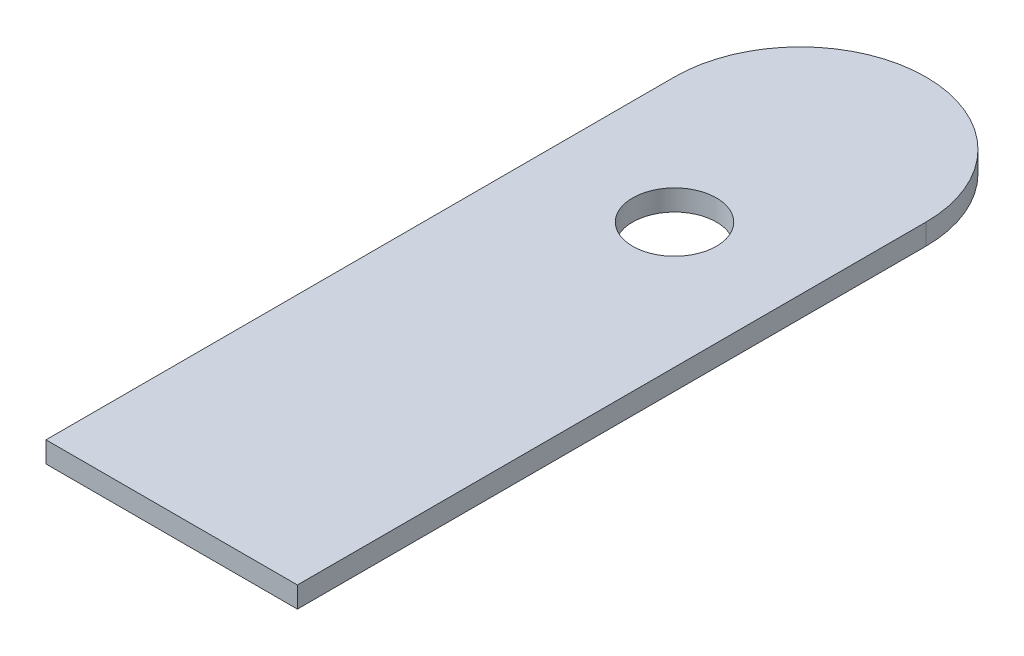
ISO-10303-21;
HEADER;
FILE_DESCRIPTION(('STEP AP214'),'2;1');
FILE_NAME('part.step','',(''),(''),'','','');
FILE_SCHEMA(('AUTOMOTIVE_DESIGN { 1 0 10303 214 1 1 1 1 }'));
ENDSEC;
DATA;
#1=APPLICATION_CONTEXT('core data for automotive mechanical design processes');
#2=APPLICATION_PROTOCOL_DEFINITION('international standard','automotive_design',2000,#1);
#3=PRODUCT_CONTEXT('',#1,'mechanical');
#4=PRODUCT('Part','Part','',(#3));
#5=PRODUCT_RELATED_PRODUCT_CATEGORY('part','',(#4));
#6=PRODUCT_DEFINITION_FORMATION('','',#4);
#7=PRODUCT_DEFINITION_CONTEXT('part definition',#1,'design');
#8=PRODUCT_DEFINITION('design','',#6,#7);
#9=PRODUCT_DEFINITION_SHAPE('','',#8);
#10=(LENGTH_UNIT() NAMED_UNIT(*) SI_UNIT(.MILLI.,.METRE.));
#11=(NAMED_UNIT(*) PLANE_ANGLE_UNIT() SI_UNIT($,.RADIAN.));
#12=(NAMED_UNIT(*) SI_UNIT($,.STERADIAN.) SOLID_ANGLE_UNIT());
#13=UNCERTAINTY_MEASURE_WITH_UNIT(LENGTH_MEASURE(1.E-05),#10,'distance_accuracy_value','');
#14=(GEOMETRIC_REPRESENTATION_CONTEXT(3) GLOBAL_UNCERTAINTY_ASSIGNED_CONTEXT((#13)) GLOBAL_UNIT_ASSIGNED_CONTEXT((#10,
#11,#12)) REPRESENTATION_CONTEXT('',''));
#15=CARTESIAN_POINT('',(0.,0.,0.));
#16=DIRECTION('',(0.,0.,1.));
#17=DIRECTION('',(1.,0.,0.));
#18=AXIS2_PLACEMENT_3D('',#15,#16,#17);
#19=CARTESIAN_POINT('',(0.,6.35,0.));
#20=DIRECTION('',(0.,1.,0.));
#21=DIRECTION('',(0.,0.,1.));
#22=AXIS2_PLACEMENT_3D('',#19,#20,#21);
#23=PLANE('',#22);
#24=CARTESIAN_POINT('',(0.,6.35,-76.2));
#25=DIRECTION('',(0.,1.,0.));
#26=DIRECTION('',(0.,0.,1.));
#27=AXIS2_PLACEMENT_3D('',#24,#25,#26);
#28=CIRCLE('',#27,38.1);
#29=CARTESIAN_POINT('',(38.1,6.35,-76.2));
#30=VERTEX_POINT('',#29);
#31=CARTESIAN_POINT('',(0.,6.35,-114.3));
#32=VERTEX_POINT('',#31);
#33=EDGE_CURVE('E61',#30,#32,#28,.T.);
#34=ORIENTED_EDGE('',*,*,#33,.T.);
#35=CARTESIAN_POINT('',(0.,6.35,-76.2));
#36=DIRECTION('',(0.,1.,0.));
#37=DIRECTION('',(0.,0.,1.));
#38=AXIS2_PLACEMENT_3D('',#35,#36,#37);
#39=CIRCLE('',#38,38.1);
#40=CARTESIAN_POINT('',(-38.1,6.35,-76.2));
#41=VERTEX_POINT('',#40);
#42=EDGE_CURVE('E54',#32,#41,#39,.T.);
#43=ORIENTED_EDGE('',*,*,#42,.T.);
#44=DIRECTION('',(0.,0.,1.));
#45=VECTOR('',#44,1.);
#46=CARTESIAN_POINT('',(-38.1,6.35,-114.3));
#47=LINE('',#46,#45);
#48=CARTESIAN_POINT('',(-38.1,6.35,114.3));
#49=VERTEX_POINT('',#48);
#50=EDGE_CURVE('E91',#41,#49,#47,.T.);
#51=ORIENTED_EDGE('',*,*,#50,.T.);
#52=DIRECTION('',(1.,0.,0.));
#53=VECTOR('',#52,1.);
#54=CARTESIAN_POINT('',(-38.1,6.35,114.3));
#55=LINE('',#54,#53);
#56=CARTESIAN_POINT('',(38.1,6.35,114.3));
#57=VERTEX_POINT('',#56);
#58=EDGE_CURVE('E95',#49,#57,#55,.T.);
#59=ORIENTED_EDGE('',*,*,#58,.T.);
#60=DIRECTION('',(0.,0.,-1.));
#61=VECTOR('',#60,1.);
#62=CARTESIAN_POINT('',(38.1,6.35,-114.3));
#63=LINE('',#62,#61);
#64=EDGE_CURVE('E102',#57,#30,#63,.T.);
#65=ORIENTED_EDGE('',*,*,#64,.T.);
#66=EDGE_LOOP('',(#34,#43,#51,#59,#65));
#67=FACE_BOUND('',#66,.T.);
#68=CARTESIAN_POINT('',(0.,6.35,-38.1));
#69=DIRECTION('',(0.,1.,0.));
#70=DIRECTION('',(0.,0.,1.));
#71=AXIS2_PLACEMENT_3D('',#68,#69,#70);
#72=CIRCLE('',#71,12.7);
#73=CARTESIAN_POINT('',(0.,6.35,-25.4));
#74=VERTEX_POINT('',#73);
#75=EDGE_CURVE('E126',#74,#74,#72,.T.);
#76=ORIENTED_EDGE('',*,*,#75,.F.);
#77=EDGE_LOOP('',(#76));
#78=FACE_BOUND('',#77,.T.);
#79=ADVANCED_FACE('F44',(#67,#78),#23,.T.);
#80=CARTESIAN_POINT('',(0.,0.,0.));
#81=DIRECTION('',(0.,1.,0.));
#82=DIRECTION('',(0.,0.,1.));
#83=AXIS2_PLACEMENT_3D('',#80,#81,#82);
#84=PLANE('',#83);
#85=DIRECTION('',(0.,0.,1.));
#86=VECTOR('',#85,1.);
#87=CARTESIAN_POINT('',(-38.1,0.,-114.3));
#88=LINE('',#87,#86);
#89=CARTESIAN_POINT('',(-38.1,0.,-76.2));
#90=VERTEX_POINT('',#89);
#91=CARTESIAN_POINT('',(-38.1,0.,114.3));
#92=VERTEX_POINT('',#91);
#93=EDGE_CURVE('E108',#90,#92,#88,.T.);
#94=ORIENTED_EDGE('',*,*,#93,.F.);
#95=CARTESIAN_POINT('',(0.,0.,-76.2));
#96=DIRECTION('',(0.,1.,0.));
#97=DIRECTION('',(0.,0.,1.));
#98=AXIS2_PLACEMENT_3D('',#95,#96,#97);
#99=CIRCLE('',#98,38.1);
#100=CARTESIAN_POINT('',(0.,0.,-114.3));
#101=VERTEX_POINT('',#100);
#102=EDGE_CURVE('E137',#90,#101,#99,.F.);
#103=ORIENTED_EDGE('',*,*,#102,.T.);
#104=CARTESIAN_POINT('',(0.,0.,-76.2));
#105=DIRECTION('',(0.,1.,0.));
#106=DIRECTION('',(0.,0.,1.));
#107=AXIS2_PLACEMENT_3D('',#104,#105,#106);
#108=CIRCLE('',#107,38.1);
#109=CARTESIAN_POINT('',(38.1,0.,-76.2));
#110=VERTEX_POINT('',#109);
#111=EDGE_CURVE('E134',#101,#110,#108,.F.);
#112=ORIENTED_EDGE('',*,*,#111,.T.);
#113=DIRECTION('',(0.,0.,-1.));
#114=VECTOR('',#113,1.);
#115=CARTESIAN_POINT('',(38.1,0.,-114.3));
#116=LINE('',#115,#114);
#117=CARTESIAN_POINT('',(38.1,0.,114.3));
#118=VERTEX_POINT('',#117);
#119=EDGE_CURVE('E123',#118,#110,#116,.T.);
#120=ORIENTED_EDGE('',*,*,#119,.F.);
#121=DIRECTION('',(1.,0.,0.));
#122=VECTOR('',#121,1.);
#123=CARTESIAN_POINT('',(-38.1,0.,114.3));
#124=LINE('',#123,#122);
#125=EDGE_CURVE('E129',#92,#118,#124,.T.);
#126=ORIENTED_EDGE('',*,*,#125,.F.);
#127=EDGE_LOOP('',(#94,#103,#112,#120,#126));
#128=FACE_BOUND('',#127,.T.);
#129=CARTESIAN_POINT('',(0.,0.,-38.1));
#130=DIRECTION('',(0.,1.,0.));
#131=DIRECTION('',(0.,0.,1.));
#132=AXIS2_PLACEMENT_3D('',#129,#130,#131);
#133=CIRCLE('',#132,12.7);
#134=CARTESIAN_POINT('',(0.,0.,-25.4));
#135=VERTEX_POINT('',#134);
#136=EDGE_CURVE('E153',#135,#135,#133,.T.);
#137=ORIENTED_EDGE('',*,*,#136,.T.);
#138=EDGE_LOOP('',(#137));
#139=FACE_BOUND('',#138,.T.);
#140=ADVANCED_FACE('F145',(#128,#139),#84,.F.);
#141=CARTESIAN_POINT('',(38.1,6.35,-114.3));
#142=DIRECTION('',(-1.,0.,0.));
#143=DIRECTION('',(0.,0.,1.));
#144=AXIS2_PLACEMENT_3D('',#141,#142,#143);
#145=PLANE('',#144);
#146=ORIENTED_EDGE('',*,*,#119,.T.);
#147=DIRECTION('',(0.,-1.,0.));
#148=VECTOR('',#147,1.);
#149=CARTESIAN_POINT('',(38.1,6.35,-76.2));
#150=LINE('',#149,#148);
#151=EDGE_CURVE('E11',#110,#30,#150,.F.);
#152=ORIENTED_EDGE('',*,*,#151,.T.);
#153=ORIENTED_EDGE('',*,*,#64,.F.);
#154=DIRECTION('',(0.,-1.,0.));
#155=VECTOR('',#154,1.);
#156=CARTESIAN_POINT('',(38.1,6.35,114.3));
#157=LINE('',#156,#155);
#158=EDGE_CURVE('E113',#57,#118,#157,.T.);
#159=ORIENTED_EDGE('',*,*,#158,.T.);
#160=EDGE_LOOP('',(#146,#152,#153,#159));
#161=FACE_BOUND('',#160,.T.);
#162=ADVANCED_FACE('F162',(#161),#145,.F.);
#163=CARTESIAN_POINT('',(-38.1,6.35,-114.3));
#164=DIRECTION('',(1.,0.,0.));
#165=DIRECTION('',(0.,0.,-1.));
#166=AXIS2_PLACEMENT_3D('',#163,#164,#165);
#167=PLANE('',#166);
#168=ORIENTED_EDGE('',*,*,#50,.F.);
#169=DIRECTION('',(0.,-1.,0.));
#170=VECTOR('',#169,1.);
#171=CARTESIAN_POINT('',(-38.1,6.35,-76.2));
#172=LINE('',#171,#170);
#173=EDGE_CURVE('E112',#41,#90,#172,.T.);
#174=ORIENTED_EDGE('',*,*,#173,.T.);
#175=ORIENTED_EDGE('',*,*,#93,.T.);
#176=DIRECTION('',(0.,-1.,0.));
#177=VECTOR('',#176,1.);
#178=CARTESIAN_POINT('',(-38.1,6.35,114.3));
#179=LINE('',#178,#177);
#180=EDGE_CURVE('E105',#49,#92,#179,.T.);
#181=ORIENTED_EDGE('',*,*,#180,.F.);
#182=EDGE_LOOP('',(#168,#174,#175,#181));
#183=FACE_BOUND('',#182,.T.);
#184=ADVANCED_FACE('F106',(#183),#167,.F.);
#185=CARTESIAN_POINT('',(-38.1,6.35,114.3));
#186=DIRECTION('',(0.,0.,-1.));
#187=DIRECTION('',(-1.,0.,0.));
#188=AXIS2_PLACEMENT_3D('',#185,#186,#187);
#189=PLANE('',#188);
#190=ORIENTED_EDGE('',*,*,#125,.T.);
#191=ORIENTED_EDGE('',*,*,#158,.F.);
#192=ORIENTED_EDGE('',*,*,#58,.F.);
#193=ORIENTED_EDGE('',*,*,#180,.T.);
#194=EDGE_LOOP('',(#190,#191,#192,#193));
#195=FACE_BOUND('',#194,.T.);
#196=ADVANCED_FACE('F115',(#195),#189,.F.);
#197=CARTESIAN_POINT('',(0.,6.35,-38.1));
#198=DIRECTION('',(0.,-1.,0.));
#199=DIRECTION('',(0.,0.,-1.));
#200=AXIS2_PLACEMENT_3D('',#197,#198,#199);
#201=CYLINDRICAL_SURFACE('',#200,12.7);
#202=ORIENTED_EDGE('',*,*,#75,.T.);
#203=EDGE_LOOP('',(#202));
#204=FACE_BOUND('',#203,.T.);
#205=ORIENTED_EDGE('',*,*,#136,.F.);
#206=EDGE_LOOP('',(#205));
#207=FACE_BOUND('',#206,.T.);
#208=ADVANCED_FACE('F177',(#204,#207),#201,.F.);
#209=CARTESIAN_POINT('',(0.,6.35,-76.2));
#210=DIRECTION('',(0.,-1.,0.));
#211=DIRECTION('',(0.,0.,-1.));
#212=AXIS2_PLACEMENT_3D('',#209,#210,#211);
#213=CYLINDRICAL_SURFACE('',#212,38.1);
#214=DIRECTION('',(0.,-1.,0.));
#215=VECTOR('',#214,1.);
#216=CARTESIAN_POINT('',(0.,6.35,-114.3));
#217=LINE('',#216,#215);
#218=EDGE_CURVE('E48',#32,#101,#217,.T.);
#219=ORIENTED_EDGE('',*,*,#218,.F.);
#220=ORIENTED_EDGE('',*,*,#33,.F.);
#221=ORIENTED_EDGE('',*,*,#151,.F.);
#222=ORIENTED_EDGE('',*,*,#111,.F.);
#223=EDGE_LOOP('',(#219,#220,#221,#222));
#224=FACE_BOUND('',#223,.T.);
#225=ADVANCED_FACE('F46',(#224),#213,.T.);
#226=CARTESIAN_POINT('',(0.,6.35,-76.2));
#227=DIRECTION('',(0.,-1.,0.));
#228=DIRECTION('',(0.,0.,-1.));
#229=AXIS2_PLACEMENT_3D('',#226,#227,#228);
#230=CYLINDRICAL_SURFACE('',#229,38.1);
#231=ORIENTED_EDGE('',*,*,#42,.F.);
#232=ORIENTED_EDGE('',*,*,#218,.T.);
#233=ORIENTED_EDGE('',*,*,#102,.F.);
#234=ORIENTED_EDGE('',*,*,#173,.F.);
#235=EDGE_LOOP('',(#231,#232,#233,#234));
#236=FACE_BOUND('',#235,.T.);
#237=ADVANCED_FACE('F151',(#236),#230,.T.);
#238=CLOSED_SHELL('',(#79,#140,#162,#184,#196,#208,#225,#237));
#239=MANIFOLD_SOLID_BREP('B2',#238);
#240=ADVANCED_BREP_SHAPE_REPRESENTATION('',(#18,#239),#14);
#241=SHAPE_DEFINITION_REPRESENTATION(#9,#240);
ENDSEC;
END-ISO-10303-21;
